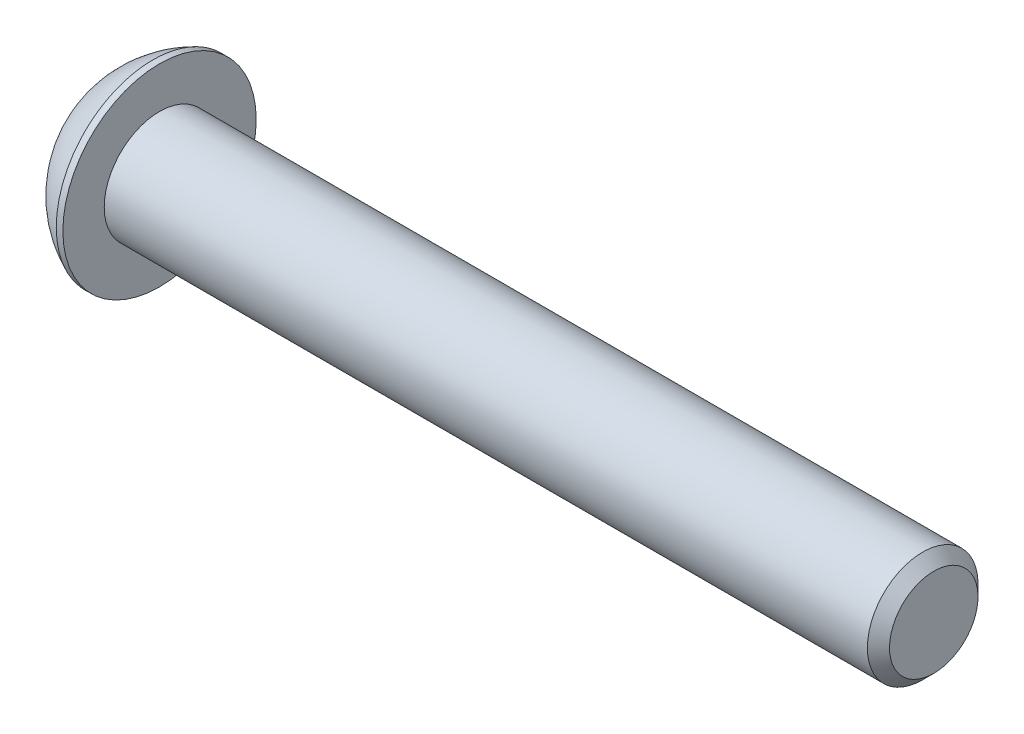
ISO-10303-21;
HEADER;
FILE_DESCRIPTION(('STEP AP214'),'2;1');
FILE_NAME('part.step','',(''),(''),'','','');
FILE_SCHEMA(('AUTOMOTIVE_DESIGN { 1 0 10303 214 1 1 1 1 }'));
ENDSEC;
DATA;
#1=APPLICATION_CONTEXT('core data for automotive mechanical design processes');
#2=APPLICATION_PROTOCOL_DEFINITION('international standard','automotive_design',2000,#1);
#3=PRODUCT_CONTEXT('',#1,'mechanical');
#4=PRODUCT('Part','Part','',(#3));
#5=PRODUCT_RELATED_PRODUCT_CATEGORY('part','',(#4));
#6=PRODUCT_DEFINITION_FORMATION('','',#4);
#7=PRODUCT_DEFINITION_CONTEXT('part definition',#1,'design');
#8=PRODUCT_DEFINITION('design','',#6,#7);
#9=PRODUCT_DEFINITION_SHAPE('','',#8);
#10=(LENGTH_UNIT() NAMED_UNIT(*) SI_UNIT(.MILLI.,.METRE.));
#11=(NAMED_UNIT(*) PLANE_ANGLE_UNIT() SI_UNIT($,.RADIAN.));
#12=(NAMED_UNIT(*) SI_UNIT($,.STERADIAN.) SOLID_ANGLE_UNIT());
#13=UNCERTAINTY_MEASURE_WITH_UNIT(LENGTH_MEASURE(1.E-05),#10,'distance_accuracy_value','');
#14=(GEOMETRIC_REPRESENTATION_CONTEXT(3) GLOBAL_UNCERTAINTY_ASSIGNED_CONTEXT((#13)) GLOBAL_UNIT_ASSIGNED_CONTEXT((#10,
#11,#12)) REPRESENTATION_CONTEXT('',''));
#15=CARTESIAN_POINT('',(0.,0.,0.));
#16=DIRECTION('',(0.,0.,1.));
#17=DIRECTION('',(1.,0.,0.));
#18=AXIS2_PLACEMENT_3D('',#15,#16,#17);
#19=CARTESIAN_POINT('',(1.32080000000034,0.,0.));
#20=DIRECTION('',(-1.,0.,0.));
#21=DIRECTION('',(0.,0.,1.));
#22=AXIS2_PLACEMENT_3D('',#19,#20,#21);
#23=CONICAL_SURFACE('',#22,1.1937999999998,1.04719755119608);
#24=CARTESIAN_POINT('',(2.01004075135902,0.,-4.44089209850063E-13));
#25=VERTEX_POINT('',#24);
#26=VERTEX_LOOP('',#25);
#27=FACE_BOUND('',#26,.T.);
#28=CARTESIAN_POINT('',(1.32080000000009,0.,0.));
#29=DIRECTION('',(-1.,0.,0.));
#30=DIRECTION('',(0.,0.,1.));
#31=AXIS2_PLACEMENT_3D('',#28,#29,#30);
#32=CIRCLE('',#31,1.19380000000024);
#33=CARTESIAN_POINT('',(1.32080000000009,0.,1.19380000000024));
#34=VERTEX_POINT('',#33);
#35=EDGE_CURVE('E20',#34,#34,#32,.T.);
#36=ORIENTED_EDGE('',*,*,#35,.T.);
#37=EDGE_LOOP('',(#36));
#38=FACE_BOUND('',#37,.T.);
#39=ADVANCED_FACE('F17',(#27,#38),#23,.F.);
#40=CARTESIAN_POINT('',(1.3208,-2.29135888084633,0.));
#41=DIRECTION('',(1.,0.,0.));
#42=DIRECTION('',(0.,0.,-1.));
#43=AXIS2_PLACEMENT_3D('',#40,#41,#42);
#44=PLANE('',#43);
#45=DIRECTION('',(0.,1.,0.));
#46=VECTOR('',#45,1.);
#47=CARTESIAN_POINT('',(1.3208,-1.14567944042316,1.984375));
#48=LINE('',#47,#46);
#49=CARTESIAN_POINT('',(1.3208,1.14567944042316,1.984375));
#50=VERTEX_POINT('',#49);
#51=CARTESIAN_POINT('',(1.3208,-1.14567944042316,1.984375));
#52=VERTEX_POINT('',#51);
#53=EDGE_CURVE('E69',#50,#52,#48,.F.);
#54=ORIENTED_EDGE('',*,*,#53,.F.);
#55=DIRECTION('',(0.,0.5,-0.866025403784439));
#56=VECTOR('',#55,1.);
#57=CARTESIAN_POINT('',(1.3208,1.14567944042316,1.984375));
#58=LINE('',#57,#56);
#59=CARTESIAN_POINT('',(1.3208,2.29135888084633,0.));
#60=VERTEX_POINT('',#59);
#61=EDGE_CURVE('E255',#60,#50,#58,.F.);
#62=ORIENTED_EDGE('',*,*,#61,.F.);
#63=DIRECTION('',(0.,-0.5,-0.866025403784439));
#64=VECTOR('',#63,1.);
#65=CARTESIAN_POINT('',(1.3208,2.29135888084633,0.));
#66=LINE('',#65,#64);
#67=CARTESIAN_POINT('',(1.3208,1.14567944042316,-1.984375));
#68=VERTEX_POINT('',#67);
#69=EDGE_CURVE('E259',#68,#60,#66,.F.);
#70=ORIENTED_EDGE('',*,*,#69,.F.);
#71=DIRECTION('',(0.,1.,0.));
#72=VECTOR('',#71,1.);
#73=CARTESIAN_POINT('',(1.3208,1.14567944042316,-1.984375));
#74=LINE('',#73,#72);
#75=CARTESIAN_POINT('',(1.3208,-1.14567944042316,-1.984375));
#76=VERTEX_POINT('',#75);
#77=EDGE_CURVE('E264',#76,#68,#74,.T.);
#78=ORIENTED_EDGE('',*,*,#77,.F.);
#79=DIRECTION('',(0.,-0.500000000000001,0.866025403784438));
#80=VECTOR('',#79,1.);
#81=CARTESIAN_POINT('',(1.3208,-1.14567944042316,-1.984375));
#82=LINE('',#81,#80);
#83=CARTESIAN_POINT('',(1.3208,-2.29135888084633,0.));
#84=VERTEX_POINT('',#83);
#85=EDGE_CURVE('E269',#84,#76,#82,.F.);
#86=ORIENTED_EDGE('',*,*,#85,.F.);
#87=DIRECTION('',(0.,0.500000000000001,0.866025403784438));
#88=VECTOR('',#87,1.);
#89=CARTESIAN_POINT('',(1.3208,-2.29135888084633,0.));
#90=LINE('',#89,#88);
#91=EDGE_CURVE('E82',#52,#84,#90,.F.);
#92=ORIENTED_EDGE('',*,*,#91,.F.);
#93=EDGE_LOOP('',(#54,#62,#70,#78,#86,#92));
#94=FACE_BOUND('',#93,.T.);
#95=ORIENTED_EDGE('',*,*,#35,.F.);
#96=EDGE_LOOP('',(#95));
#97=FACE_BOUND('',#96,.T.);
#98=ADVANCED_FACE('F75',(#94,#97),#44,.F.);
#99=CARTESIAN_POINT('',(1.3208,-1.14567944042316,1.984375));
#100=DIRECTION('',(0.,0.,-1.));
#101=DIRECTION('',(0.,1.,0.));
#102=AXIS2_PLACEMENT_3D('',#99,#100,#101);
#103=PLANE('',#102);
#104=ORIENTED_EDGE('',*,*,#53,.T.);
#105=DIRECTION('',(1.,0.,0.));
#106=VECTOR('',#105,1.);
#107=CARTESIAN_POINT('',(1.3208,-1.14567944042316,1.984375));
#108=LINE('',#107,#106);
#109=CARTESIAN_POINT('',(0.,-1.14567944042316,1.984375));
#110=VERTEX_POINT('',#109);
#111=EDGE_CURVE('E79',#110,#52,#108,.T.);
#112=ORIENTED_EDGE('',*,*,#111,.F.);
#113=DIRECTION('',(0.,1.,0.));
#114=VECTOR('',#113,1.);
#115=CARTESIAN_POINT('',(0.,0.,1.984375));
#116=LINE('',#115,#114);
#117=CARTESIAN_POINT('',(0.,1.14567944042316,1.984375));
#118=VERTEX_POINT('',#117);
#119=EDGE_CURVE('E249',#118,#110,#116,.F.);
#120=ORIENTED_EDGE('',*,*,#119,.F.);
#121=DIRECTION('',(1.,0.,0.));
#122=VECTOR('',#121,1.);
#123=CARTESIAN_POINT('',(1.3208,1.14567944042316,1.984375));
#124=LINE('',#123,#122);
#125=EDGE_CURVE('E252',#50,#118,#124,.F.);
#126=ORIENTED_EDGE('',*,*,#125,.F.);
#127=EDGE_LOOP('',(#104,#112,#120,#126));
#128=FACE_BOUND('',#127,.T.);
#129=ADVANCED_FACE('F128',(#128),#103,.T.);
#130=CARTESIAN_POINT('',(1.3208,-2.29135888084633,0.));
#131=DIRECTION('',(0.,0.866025403784438,-0.500000000000001));
#132=DIRECTION('',(0.,0.500000000000001,0.866025403784438));
#133=AXIS2_PLACEMENT_3D('',#130,#131,#132);
#134=PLANE('',#133);
#135=ORIENTED_EDGE('',*,*,#91,.T.);
#136=DIRECTION('',(1.,0.,0.));
#137=VECTOR('',#136,1.);
#138=CARTESIAN_POINT('',(1.3208,-2.29135888084633,0.));
#139=LINE('',#138,#137);
#140=CARTESIAN_POINT('',(0.,-2.29135888084633,0.));
#141=VERTEX_POINT('',#140);
#142=EDGE_CURVE('E271',#141,#84,#139,.T.);
#143=ORIENTED_EDGE('',*,*,#142,.F.);
#144=DIRECTION('',(0.,-0.500000000000001,-0.866025403784438));
#145=VECTOR('',#144,1.);
#146=CARTESIAN_POINT('',(0.,-1.14567944042316,1.984375));
#147=LINE('',#146,#145);
#148=EDGE_CURVE('E246',#110,#141,#147,.T.);
#149=ORIENTED_EDGE('',*,*,#148,.F.);
#150=ORIENTED_EDGE('',*,*,#111,.T.);
#151=EDGE_LOOP('',(#135,#143,#149,#150));
#152=FACE_BOUND('',#151,.T.);
#153=ADVANCED_FACE('F124',(#152),#134,.T.);
#154=CARTESIAN_POINT('',(1.3208,-1.14567944042316,-1.984375));
#155=DIRECTION('',(0.,0.866025403784438,0.500000000000001));
#156=DIRECTION('',(0.,-0.500000000000001,0.866025403784438));
#157=AXIS2_PLACEMENT_3D('',#154,#155,#156);
#158=PLANE('',#157);
#159=ORIENTED_EDGE('',*,*,#85,.T.);
#160=DIRECTION('',(1.,0.,0.));
#161=VECTOR('',#160,1.);
#162=CARTESIAN_POINT('',(1.3208,-1.14567944042316,-1.984375));
#163=LINE('',#162,#161);
#164=CARTESIAN_POINT('',(0.,-1.14567944042316,-1.984375));
#165=VERTEX_POINT('',#164);
#166=EDGE_CURVE('E266',#165,#76,#163,.T.);
#167=ORIENTED_EDGE('',*,*,#166,.F.);
#168=DIRECTION('',(0.,0.500000000000001,-0.866025403784438));
#169=VECTOR('',#168,1.);
#170=CARTESIAN_POINT('',(0.,-2.29135888084633,0.));
#171=LINE('',#170,#169);
#172=EDGE_CURVE('E243',#141,#165,#171,.T.);
#173=ORIENTED_EDGE('',*,*,#172,.F.);
#174=ORIENTED_EDGE('',*,*,#142,.T.);
#175=EDGE_LOOP('',(#159,#167,#173,#174));
#176=FACE_BOUND('',#175,.T.);
#177=ADVANCED_FACE('F120',(#176),#158,.T.);
#178=CARTESIAN_POINT('',(1.3208,1.14567944042316,-1.984375));
#179=DIRECTION('',(0.,0.,1.));
#180=DIRECTION('',(1.,0.,0.));
#181=AXIS2_PLACEMENT_3D('',#178,#179,#180);
#182=PLANE('',#181);
#183=ORIENTED_EDGE('',*,*,#77,.T.);
#184=DIRECTION('',(1.,0.,0.));
#185=VECTOR('',#184,1.);
#186=CARTESIAN_POINT('',(1.3208,1.14567944042316,-1.984375));
#187=LINE('',#186,#185);
#188=CARTESIAN_POINT('',(0.,1.14567944042316,-1.984375));
#189=VERTEX_POINT('',#188);
#190=EDGE_CURVE('E261',#189,#68,#187,.T.);
#191=ORIENTED_EDGE('',*,*,#190,.F.);
#192=DIRECTION('',(0.,1.,0.));
#193=VECTOR('',#192,1.);
#194=CARTESIAN_POINT('',(0.,0.,-1.984375));
#195=LINE('',#194,#193);
#196=EDGE_CURVE('E240',#165,#189,#195,.T.);
#197=ORIENTED_EDGE('',*,*,#196,.F.);
#198=ORIENTED_EDGE('',*,*,#166,.T.);
#199=EDGE_LOOP('',(#183,#191,#197,#198));
#200=FACE_BOUND('',#199,.T.);
#201=ADVANCED_FACE('F117',(#200),#182,.T.);
#202=CARTESIAN_POINT('',(1.3208,2.29135888084633,0.));
#203=DIRECTION('',(0.,-0.866025403784439,0.5));
#204=DIRECTION('',(0.,-0.5,-0.866025403784439));
#205=AXIS2_PLACEMENT_3D('',#202,#203,#204);
#206=PLANE('',#205);
#207=ORIENTED_EDGE('',*,*,#69,.T.);
#208=DIRECTION('',(1.,0.,0.));
#209=VECTOR('',#208,1.);
#210=CARTESIAN_POINT('',(1.3208,2.29135888084633,0.));
#211=LINE('',#210,#209);
#212=CARTESIAN_POINT('',(0.,2.29135888084633,0.));
#213=VERTEX_POINT('',#212);
#214=EDGE_CURVE('E35',#213,#60,#211,.T.);
#215=ORIENTED_EDGE('',*,*,#214,.F.);
#216=DIRECTION('',(0.,0.5,0.866025403784439));
#217=VECTOR('',#216,1.);
#218=CARTESIAN_POINT('',(0.,1.14567944042316,-1.984375));
#219=LINE('',#218,#217);
#220=EDGE_CURVE('E237',#189,#213,#219,.T.);
#221=ORIENTED_EDGE('',*,*,#220,.F.);
#222=ORIENTED_EDGE('',*,*,#190,.T.);
#223=EDGE_LOOP('',(#207,#215,#221,#222));
#224=FACE_BOUND('',#223,.T.);
#225=ADVANCED_FACE('F113',(#224),#206,.T.);
#226=CARTESIAN_POINT('',(1.3208,1.14567944042316,1.984375));
#227=DIRECTION('',(0.,-0.866025403784439,-0.5));
#228=DIRECTION('',(0.,0.5,-0.866025403784439));
#229=AXIS2_PLACEMENT_3D('',#226,#227,#228);
#230=PLANE('',#229);
#231=ORIENTED_EDGE('',*,*,#61,.T.);
#232=ORIENTED_EDGE('',*,*,#125,.T.);
#233=DIRECTION('',(0.,-0.5,0.866025403784438));
#234=VECTOR('',#233,1.);
#235=CARTESIAN_POINT('',(0.,2.29135888084633,0.));
#236=LINE('',#235,#234);
#237=EDGE_CURVE('E100',#213,#118,#236,.T.);
#238=ORIENTED_EDGE('',*,*,#237,.F.);
#239=ORIENTED_EDGE('',*,*,#214,.T.);
#240=EDGE_LOOP('',(#231,#232,#238,#239));
#241=FACE_BOUND('',#240,.T.);
#242=ADVANCED_FACE('F109',(#241),#230,.T.);
#243=CARTESIAN_POINT('',(0.,0.,0.));
#244=DIRECTION('',(-1.,0.,0.));
#245=DIRECTION('',(0.,0.,1.));
#246=AXIS2_PLACEMENT_3D('',#243,#244,#245);
#247=PLANE('',#246);
#248=ORIENTED_EDGE('',*,*,#220,.T.);
#249=ORIENTED_EDGE('',*,*,#237,.T.);
#250=ORIENTED_EDGE('',*,*,#119,.T.);
#251=ORIENTED_EDGE('',*,*,#148,.T.);
#252=ORIENTED_EDGE('',*,*,#172,.T.);
#253=ORIENTED_EDGE('',*,*,#196,.T.);
#254=EDGE_LOOP('',(#248,#249,#250,#251,#252,#253));
#255=FACE_BOUND('',#254,.T.);
#256=CARTESIAN_POINT('',(0.,2.77495,0.));
#257=CARTESIAN_POINT('',(0.,2.77494953309947,0.077911893752346));
#258=CARTESIAN_POINT('',(0.,2.77166578388025,0.15583810591977));
#259=CARTESIAN_POINT('',(0.,2.75855213600204,0.311152012455904));
#260=CARTESIAN_POINT('',(0.,2.74872030471467,0.388539541019556));
#261=CARTESIAN_POINT('',(0.,2.72255472645677,0.542341518735718));
#262=CARTESIAN_POINT('',(-2.70111753942276E-13,2.70621065843662,0.618754223567578));
#263=CARTESIAN_POINT('',(2.71199122712048E-13,2.66713326915777,0.769973634286023));
#264=CARTESIAN_POINT('',(1.01140160355389E-12,2.64439476297869,0.844778983646282));
#265=CARTESIAN_POINT('',(1.81659311492368E-12,2.5669019594335,1.06566239301792));
#266=CARTESIAN_POINT('',(4.76424972847466E-13,2.50280672569928,1.20857954243987));
#267=CARTESIAN_POINT('',(-4.75575707467107E-13,2.35149826934097,1.48160874561538));
#268=CARTESIAN_POINT('',(0.,2.26428416790396,1.61172031233499));
#269=CARTESIAN_POINT('',(0.,2.1181093928834,1.79445660654268));
#270=CARTESIAN_POINT('',(0.,2.06678693791626,1.85333128513997));
#271=CARTESIAN_POINT('',(0.,1.95940522984449,1.96650727912792));
#272=CARTESIAN_POINT('',(0.,1.90335059143535,2.02081294920044));
#273=CARTESIAN_POINT('',(0.,1.78683891013963,2.12453280878582));
#274=CARTESIAN_POINT('',(0.,1.72637988450322,2.1739447713554));
#275=CARTESIAN_POINT('',(0.,1.6015196886571,2.26750481692908));
#276=CARTESIAN_POINT('',(0.,1.53711760864537,2.31165167810848));
#277=CARTESIAN_POINT('',(0.,1.33869902291632,2.43567242603945));
#278=CARTESIAN_POINT('',(0.,1.19934704110695,2.507235886628));
#279=CARTESIAN_POINT('',(0.,0.910681609121876,2.62590828672821));
#280=CARTESIAN_POINT('',(0.,0.761368265357393,2.67301748742279));
#281=CARTESIAN_POINT('',(0.,0.456932649466618,2.74151230664007));
#282=CARTESIAN_POINT('',(0.,0.301810346322579,2.76289778778721));
#283=CARTESIAN_POINT('',(0.,-0.00982263870895675,2.77931595661156));
#284=CARTESIAN_POINT('',(0.,-0.166333320596453,2.77434864428877));
#285=CARTESIAN_POINT('',(0.,-0.476280836814457,2.73822217653073));
#286=CARTESIAN_POINT('',(0.,-0.62971768755599,2.70706316096981));
#287=CARTESIAN_POINT('',(0.,-0.92925483004428,2.6193798077115));
#288=CARTESIAN_POINT('',(0.,-1.0753550434132,2.56285519909569));
#289=CARTESIAN_POINT('',(0.,-1.2857069259858,2.46037024128109));
#290=CARTESIAN_POINT('',(0.,-1.35439130022287,2.42323494812897));
#291=CARTESIAN_POINT('',(0.,-1.488391287199,2.34331277270256));
#292=CARTESIAN_POINT('',(0.,-1.55370767631788,2.30052720108832));
#293=CARTESIAN_POINT('',(0.,-1.68047292776595,2.20962421887055));
#294=CARTESIAN_POINT('',(0.,-1.74192352786821,2.16150923122349));
#295=CARTESIAN_POINT('',(0.,-1.86060297067993,2.06024311301283));
#296=CARTESIAN_POINT('',(0.,-1.91782768181716,2.00708716697631));
#297=CARTESIAN_POINT('',(0.,-2.08239462196652,1.84072208565541));
#298=CARTESIAN_POINT('',(0.,-2.18279764272602,1.72049499758422));
#299=CARTESIAN_POINT('',(0.,-2.36195754944064,1.46487629213019));
#300=CARTESIAN_POINT('',(0.,-2.44071525816758,1.32948525142808));
#301=CARTESIAN_POINT('',(0.,-2.54098882695274,1.11796734074395));
#302=CARTESIAN_POINT('',(0.,-2.57146177392728,1.04596540008348));
#303=CARTESIAN_POINT('',(0.,-2.62621251109,0.899689259475769));
#304=CARTESIAN_POINT('',(0.,-2.65049531495564,0.825416953360957));
#305=CARTESIAN_POINT('',(0.,-2.69267708798767,0.675215808695211));
#306=CARTESIAN_POINT('',(0.,-2.71058613777938,0.599289789313095));
#307=CARTESIAN_POINT('',(0.,-2.73994710360128,0.446213628496935));
#308=CARTESIAN_POINT('',(0.,-2.75140092413872,0.369063855024791));
#309=CARTESIAN_POINT('',(0.,-2.76470470685523,0.243162088173433));
#310=CARTESIAN_POINT('',(0.,-2.76854547596619,0.194611672428578));
#311=CARTESIAN_POINT('',(0.,-2.77366826843265,0.0973760351839821));
#312=CARTESIAN_POINT('',(0.,-2.77495029178815,0.04869081368424));
#313=CARTESIAN_POINT('',(0.,-2.77494953309948,-0.0779118937523475));
#314=CARTESIAN_POINT('',(0.,-2.77166578388026,-0.155838105919772));
#315=CARTESIAN_POINT('',(0.,-2.75855213600205,-0.311152012455906));
#316=CARTESIAN_POINT('',(0.,-2.74872030471469,-0.388539541019559));
#317=CARTESIAN_POINT('',(0.,-2.72255472645678,-0.54234151873572));
#318=CARTESIAN_POINT('',(-2.70430332641578E-13,-2.70621065843664,-0.61875422356758));
#319=CARTESIAN_POINT('',(2.71517960478941E-13,-2.66713326915778,-0.769973634286026));
#320=CARTESIAN_POINT('',(1.01275560390505E-12,-2.6443947629787,-0.844778983646286));
#321=CARTESIAN_POINT('',(1.81908746978714E-12,-2.56690195943352,-1.06566239301793));
#322=CARTESIAN_POINT('',(4.77073664932017E-13,-2.5028067256993,-1.20857954243988));
#323=CARTESIAN_POINT('',(-4.76224424213799E-13,-2.35149826934098,-1.48160874561538));
#324=CARTESIAN_POINT('',(0.,-2.26428416790397,-1.61172031233499));
#325=CARTESIAN_POINT('',(0.,-2.11810939288341,-1.79445660654268));
#326=CARTESIAN_POINT('',(0.,-2.06678693791627,-1.85333128513997));
#327=CARTESIAN_POINT('',(0.,-1.9594052298445,-1.96650727912792));
#328=CARTESIAN_POINT('',(0.,-1.90335059143536,-2.02081294920045));
#329=CARTESIAN_POINT('',(0.,-1.78683891013963,-2.12453280878582));
#330=CARTESIAN_POINT('',(0.,-1.72637988450323,-2.1739447713554));
#331=CARTESIAN_POINT('',(0.,-1.60151968865711,-2.26750481692909));
#332=CARTESIAN_POINT('',(0.,-1.53711760864538,-2.31165167810848));
#333=CARTESIAN_POINT('',(0.,-1.33869902291632,-2.43567242603945));
#334=CARTESIAN_POINT('',(0.,-1.19934704110696,-2.50723588662801));
#335=CARTESIAN_POINT('',(0.,-0.910681609121886,-2.62590828672822));
#336=CARTESIAN_POINT('',(0.,-0.761368265357404,-2.67301748742279));
#337=CARTESIAN_POINT('',(0.,-0.456932649466629,-2.74151230664008));
#338=CARTESIAN_POINT('',(0.,-0.301810346322589,-2.76289778778721));
#339=CARTESIAN_POINT('',(0.,0.00982263870894727,-2.77931595661156));
#340=CARTESIAN_POINT('',(0.,0.166333320596444,-2.77434864428877));
#341=CARTESIAN_POINT('',(0.,0.476280836814448,-2.73822217653073));
#342=CARTESIAN_POINT('',(0.,0.629717687555981,-2.70706316096981));
#343=CARTESIAN_POINT('',(0.,0.929254830044271,-2.6193798077115));
#344=CARTESIAN_POINT('',(0.,1.07535504341319,-2.56285519909569));
#345=CARTESIAN_POINT('',(0.,1.28570692598579,-2.46037024128109));
#346=CARTESIAN_POINT('',(0.,1.35439130022286,-2.42323494812896));
#347=CARTESIAN_POINT('',(0.,1.48839128719899,-2.34331277270256));
#348=CARTESIAN_POINT('',(0.,1.55370767631787,-2.30052720108832));
#349=CARTESIAN_POINT('',(0.,1.68047292776594,-2.20962421887055));
#350=CARTESIAN_POINT('',(0.,1.7419235278682,-2.16150923122349));
#351=CARTESIAN_POINT('',(0.,1.86060297067992,-2.06024311301283));
#352=CARTESIAN_POINT('',(0.,1.91782768181715,-2.0070871669763));
#353=CARTESIAN_POINT('',(0.,2.08239462196651,-1.8407220856554));
#354=CARTESIAN_POINT('',(0.,2.18279764272601,-1.72049499758422));
#355=CARTESIAN_POINT('',(0.,2.36195754944063,-1.46487629213018));
#356=CARTESIAN_POINT('',(0.,2.44071525816758,-1.32948525142808));
#357=CARTESIAN_POINT('',(0.,2.54098882695274,-1.11796734074395));
#358=CARTESIAN_POINT('',(0.,2.57146177392727,-1.04596540008348));
#359=CARTESIAN_POINT('',(0.,2.62621251108998,-0.899689259475768));
#360=CARTESIAN_POINT('',(0.,2.65049531495563,-0.825416953360956));
#361=CARTESIAN_POINT('',(0.,2.69267708798766,-0.675215808695209));
#362=CARTESIAN_POINT('',(0.,2.71058613777937,-0.599289789313094));
#363=CARTESIAN_POINT('',(0.,2.73994710360127,-0.446213628496932));
#364=CARTESIAN_POINT('',(0.,2.7514009241387,-0.369063855024788));
#365=CARTESIAN_POINT('',(0.,2.76470470685522,-0.24316208817343));
#366=CARTESIAN_POINT('',(0.,2.76854547596618,-0.194611672428577));
#367=CARTESIAN_POINT('',(0.,2.77366826843264,-0.0973760351839818));
#368=CARTESIAN_POINT('',(0.,2.77495029178814,-0.0486908136842405));
#369=CARTESIAN_POINT('',(0.,2.77495,0.));
#370=B_SPLINE_CURVE_WITH_KNOTS('',3,(#256,#257,#258,#259,#260,#261,#262,#263,#264,#265,#266,
#267,#268,#269,#270,#271,#272,#273,#274,#275,#276,#277,#278,#279,#280,#281,#282,#283,#284,#285,
#286,#287,#288,#289,#290,#291,#292,#293,#294,#295,#296,#297,#298,#299,#300,#301,#302,#303,#304,
#305,#306,#307,#308,#309,#310,#311,#312,#313,#314,#315,#316,#317,#318,#319,#320,#321,#322,#323,
#324,#325,#326,#327,#328,#329,#330,#331,#332,#333,#334,#335,#336,#337,#338,#339,#340,#341,#342,
#343,#344,#345,#346,#347,#348,#349,#350,#351,#352,#353,#354,#355,#356,#357,#358,#359,#360,#361,
#362,#363,#364,#365,#366,#367,#368,#369),.UNSPECIFIED.,.T.,.F.,(4,2,2,2,2,2,2,2,2,2,2,2,2,2,2,2,
2,2,2,2,2,2,2,2,2,2,2,2,2,2,2,2,2,2,2,2,2,2,2,2,2,2,2,2,2,2,2,2,2,2,2,2,2,2,2,2,4),(0.,
0.233690856748163,0.467450716578751,0.701582538521472,0.935904756015416,1.40343220467667,
1.87097742791502,2.10505636898837,2.33890962270652,2.57286880998746,2.80688218486307,
3.27442101763127,3.74195485676358,4.2094911927139,4.67702752866418,5.14456136779642,
5.61210020056469,5.84611357544034,6.08007276272137,6.3139260164395,6.54800495751273,
7.01555018075072,7.48307762941213,7.71739984690653,7.95153166884956,8.18529152868023,
8.41898238542856,8.56502681353349,8.71107124163844,8.9447620983866,9.17852195821719,
9.41265378015991,9.64697599765386,10.1145034463151,10.5820486695535,10.8161276106268,
11.049980864345,11.2839400516259,11.5179534265015,11.9854922592697,12.453026098402,
12.9205624343523,13.3880987703026,13.8556326094349,14.3231714422031,14.5571848170788,
14.7911440043598,15.0249972580779,15.2590761991512,15.7266214223892,16.1941488710506,
16.428471088545,16.662602910488,16.8963627703187,17.130053627067,17.2760980551719,
17.4221424832769),.UNSPECIFIED.);
#371=CARTESIAN_POINT('',(0.,2.77495,0.));
#372=VERTEX_POINT('',#371);
#373=EDGE_CURVE('E94',#372,#372,#370,.T.);
#374=ORIENTED_EDGE('',*,*,#373,.F.);
#375=EDGE_LOOP('',(#374));
#376=FACE_BOUND('',#375,.T.);
#377=ADVANCED_FACE('F105',(#255,#376),#247,.T.);
#378=CARTESIAN_POINT('',(5.37260881410257,0.,0.));
#379=DIRECTION('',(0.,1.,0.));
#380=DIRECTION('',(1.,0.,0.));
#381=AXIS2_PLACEMENT_3D('',#378,#379,#380);
#382=SPHERICAL_SURFACE('',#381,6.04692260343);
#383=CARTESIAN_POINT('',(2.9718,0.,0.));
#384=DIRECTION('',(-1.,0.,0.));
#385=DIRECTION('',(0.,0.,1.));
#386=AXIS2_PLACEMENT_3D('',#383,#384,#385);
#387=CIRCLE('',#386,5.5499);
#388=CARTESIAN_POINT('',(2.9718,0.,5.5499));
#389=VERTEX_POINT('',#388);
#390=EDGE_CURVE('E92',#389,#389,#387,.F.);
#391=ORIENTED_EDGE('',*,*,#390,.F.);
#392=EDGE_LOOP('',(#391));
#393=FACE_BOUND('',#392,.T.);
#394=ORIENTED_EDGE('',*,*,#373,.T.);
#395=EDGE_LOOP('',(#394));
#396=FACE_BOUND('',#395,.T.);
#397=ADVANCED_FACE('F101',(#393,#396),#382,.T.);
#398=CARTESIAN_POINT('',(47.8028,0.,0.));
#399=DIRECTION('',(-1.,0.,0.));
#400=DIRECTION('',(0.,0.,1.));
#401=AXIS2_PLACEMENT_3D('',#398,#399,#400);
#402=PLANE('',#401);
#403=CARTESIAN_POINT('',(47.8028000000563,0.,0.));
#404=DIRECTION('',(-1.,0.,0.));
#405=DIRECTION('',(0.,-1.,0.));
#406=AXIS2_PLACEMENT_3D('',#403,#404,#405);
#407=CIRCLE('',#406,2.54000000001042);
#408=CARTESIAN_POINT('',(47.8028000000563,-2.54000000001042,0.));
#409=VERTEX_POINT('',#408);
#410=EDGE_CURVE('E89',#409,#409,#407,.T.);
#411=ORIENTED_EDGE('',*,*,#410,.F.);
#412=EDGE_LOOP('',(#411));
#413=FACE_BOUND('',#412,.T.);
#414=ADVANCED_FACE('F154',(#413),#402,.F.);
#415=CARTESIAN_POINT('',(0.,0.,0.));
#416=DIRECTION('',(-1.,0.,0.));
#417=DIRECTION('',(0.,0.,1.));
#418=AXIS2_PLACEMENT_3D('',#415,#416,#417);
#419=CYLINDRICAL_SURFACE('',#418,5.5499);
#420=ORIENTED_EDGE('',*,*,#390,.T.);
#421=EDGE_LOOP('',(#420));
#422=FACE_BOUND('',#421,.T.);
#423=CARTESIAN_POINT('',(3.3528,0.,0.));
#424=DIRECTION('',(-1.,0.,0.));
#425=DIRECTION('',(0.,0.,1.));
#426=AXIS2_PLACEMENT_3D('',#423,#424,#425);
#427=CIRCLE('',#426,5.5499);
#428=CARTESIAN_POINT('',(3.3528,0.,5.5499));
#429=VERTEX_POINT('',#428);
#430=EDGE_CURVE('E86',#429,#429,#427,.T.);
#431=ORIENTED_EDGE('',*,*,#430,.T.);
#432=EDGE_LOOP('',(#431));
#433=FACE_BOUND('',#432,.T.);
#434=ADVANCED_FACE('F151',(#422,#433),#419,.T.);
#435=CARTESIAN_POINT('',(47.1678000001248,0.,0.));
#436=DIRECTION('',(-1.,0.,0.));
#437=DIRECTION('',(0.,-1.,0.));
#438=AXIS2_PLACEMENT_3D('',#435,#436,#437);
#439=CONICAL_SURFACE('',#438,3.17499999994197,0.785398163397448);
#440=CARTESIAN_POINT('',(47.1678,0.,0.));
#441=DIRECTION('',(-1.,0.,0.));
#442=DIRECTION('',(0.,0.,1.));
#443=AXIS2_PLACEMENT_3D('',#440,#441,#442);
#444=CIRCLE('',#443,3.175);
#445=CARTESIAN_POINT('',(47.1678,0.,3.175));
#446=VERTEX_POINT('',#445);
#447=EDGE_CURVE('E26',#446,#446,#444,.T.);
#448=ORIENTED_EDGE('',*,*,#447,.F.);
#449=EDGE_LOOP('',(#448));
#450=FACE_BOUND('',#449,.T.);
#451=ORIENTED_EDGE('',*,*,#410,.T.);
#452=EDGE_LOOP('',(#451));
#453=FACE_BOUND('',#452,.T.);
#454=ADVANCED_FACE('F144',(#450,#453),#439,.T.);
#455=CARTESIAN_POINT('',(3.3528,3.17499999999999,0.));
#456=DIRECTION('',(-1.,0.,0.));
#457=DIRECTION('',(0.,0.,1.));
#458=AXIS2_PLACEMENT_3D('',#455,#456,#457);
#459=PLANE('',#458);
#460=CARTESIAN_POINT('',(3.3528,0.,0.));
#461=DIRECTION('',(-1.,0.,0.));
#462=DIRECTION('',(0.,0.,1.));
#463=AXIS2_PLACEMENT_3D('',#460,#461,#462);
#464=CIRCLE('',#463,3.175);
#465=CARTESIAN_POINT('',(3.3528,0.,3.175));
#466=VERTEX_POINT('',#465);
#467=EDGE_CURVE('E11',#466,#466,#464,.F.);
#468=ORIENTED_EDGE('',*,*,#467,.F.);
#469=EDGE_LOOP('',(#468));
#470=FACE_BOUND('',#469,.T.);
#471=ORIENTED_EDGE('',*,*,#430,.F.);
#472=EDGE_LOOP('',(#471));
#473=FACE_BOUND('',#472,.T.);
#474=ADVANCED_FACE('F138',(#470,#473),#459,.F.);
#475=CARTESIAN_POINT('',(0.,0.,0.));
#476=DIRECTION('',(-1.,0.,0.));
#477=DIRECTION('',(0.,0.,1.));
#478=AXIS2_PLACEMENT_3D('',#475,#476,#477);
#479=CYLINDRICAL_SURFACE('',#478,3.175);
#480=ORIENTED_EDGE('',*,*,#467,.T.);
#481=EDGE_LOOP('',(#480));
#482=FACE_BOUND('',#481,.T.);
#483=ORIENTED_EDGE('',*,*,#447,.T.);
#484=EDGE_LOOP('',(#483));
#485=FACE_BOUND('',#484,.T.);
#486=ADVANCED_FACE('F136',(#482,#485),#479,.T.);
#487=CLOSED_SHELL('',(#39,#98,#129,#153,#177,#201,#225,#242,#377,#397,#414,#434,#454,#474,#486));
#488=MANIFOLD_SOLID_BREP('B1',#487);
#489=ADVANCED_BREP_SHAPE_REPRESENTATION('',(#18,#488),#14);
#490=SHAPE_DEFINITION_REPRESENTATION(#9,#489);
ENDSEC;
END-ISO-10303-21;
